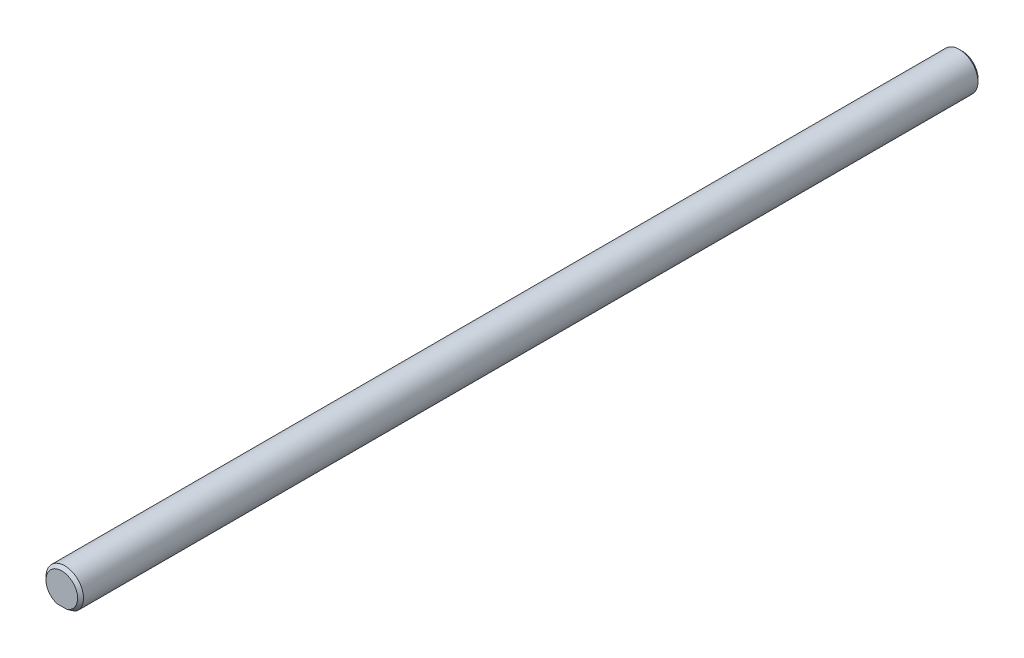
ISO-10303-21;
HEADER;
FILE_DESCRIPTION(('STEP AP214'),'2;1');
FILE_NAME('part.step','',(''),(''),'','','');
FILE_SCHEMA(('AUTOMOTIVE_DESIGN { 1 0 10303 214 1 1 1 1 }'));
ENDSEC;
DATA;
#1=APPLICATION_CONTEXT('core data for automotive mechanical design processes');
#2=APPLICATION_PROTOCOL_DEFINITION('international standard','automotive_design',2000,#1);
#3=PRODUCT_CONTEXT('',#1,'mechanical');
#4=PRODUCT('Part','Part','',(#3));
#5=PRODUCT_RELATED_PRODUCT_CATEGORY('part','',(#4));
#6=PRODUCT_DEFINITION_FORMATION('','',#4);
#7=PRODUCT_DEFINITION_CONTEXT('part definition',#1,'design');
#8=PRODUCT_DEFINITION('design','',#6,#7);
#9=PRODUCT_DEFINITION_SHAPE('','',#8);
#10=(LENGTH_UNIT() NAMED_UNIT(*) SI_UNIT(.MILLI.,.METRE.));
#11=(NAMED_UNIT(*) PLANE_ANGLE_UNIT() SI_UNIT($,.RADIAN.));
#12=(NAMED_UNIT(*) SI_UNIT($,.STERADIAN.) SOLID_ANGLE_UNIT());
#13=UNCERTAINTY_MEASURE_WITH_UNIT(LENGTH_MEASURE(1.E-05),#10,'distance_accuracy_value','');
#14=(GEOMETRIC_REPRESENTATION_CONTEXT(3) GLOBAL_UNCERTAINTY_ASSIGNED_CONTEXT((#13)) GLOBAL_UNIT_ASSIGNED_CONTEXT((#10,
#11,#12)) REPRESENTATION_CONTEXT('',''));
#15=CARTESIAN_POINT('',(0.,0.,0.));
#16=DIRECTION('',(0.,0.,1.));
#17=DIRECTION('',(1.,0.,0.));
#18=AXIS2_PLACEMENT_3D('',#15,#16,#17);
#19=CARTESIAN_POINT('',(0.,0.,-76.2));
#20=DIRECTION('',(0.,0.,-1.));
#21=DIRECTION('',(-1.,0.,0.));
#22=AXIS2_PLACEMENT_3D('',#19,#20,#21);
#23=PLANE('',#22);
#24=DIRECTION('',(1.,0.,0.));
#25=VECTOR('',#24,1.);
#26=CARTESIAN_POINT('',(-1.90500000000001,-2.54,-76.2));
#27=LINE('',#26,#25);
#28=CARTESIAN_POINT('',(-0.839061976256824,-2.54,-76.2));
#29=VERTEX_POINT('',#28);
#30=CARTESIAN_POINT('',(0.839061976256796,-2.54,-76.2));
#31=VERTEX_POINT('',#30);
#32=EDGE_CURVE('E102',#29,#31,#27,.T.);
#33=ORIENTED_EDGE('',*,*,#32,.F.);
#34=CARTESIAN_POINT('',(0.,0.,-76.2));
#35=DIRECTION('',(0.,0.,-1.));
#36=DIRECTION('',(-1.,0.,0.));
#37=AXIS2_PLACEMENT_3D('',#34,#35,#36);
#38=CIRCLE('',#37,2.675);
#39=EDGE_CURVE('E47',#29,#31,#38,.T.);
#40=ORIENTED_EDGE('',*,*,#39,.T.);
#41=EDGE_LOOP('',(#33,#40));
#42=FACE_BOUND('',#41,.T.);
#43=ADVANCED_FACE('F37',(#42),#23,.T.);
#44=CARTESIAN_POINT('',(0.,0.,76.2));
#45=DIRECTION('',(0.,0.,-1.));
#46=DIRECTION('',(-1.,0.,0.));
#47=AXIS2_PLACEMENT_3D('',#44,#45,#46);
#48=PLANE('',#47);
#49=DIRECTION('',(1.,0.,0.));
#50=VECTOR('',#49,1.);
#51=CARTESIAN_POINT('',(-1.90499999999999,-2.54,76.2));
#52=LINE('',#51,#50);
#53=CARTESIAN_POINT('',(-0.839061976256796,-2.54,76.2));
#54=VERTEX_POINT('',#53);
#55=CARTESIAN_POINT('',(0.839061976256825,-2.54,76.2));
#56=VERTEX_POINT('',#55);
#57=EDGE_CURVE('E98',#54,#56,#52,.T.);
#58=ORIENTED_EDGE('',*,*,#57,.T.);
#59=CARTESIAN_POINT('',(0.,0.,76.2));
#60=DIRECTION('',(0.,0.,-1.));
#61=DIRECTION('',(-1.,0.,0.));
#62=AXIS2_PLACEMENT_3D('',#59,#60,#61);
#63=CIRCLE('',#62,2.675);
#64=EDGE_CURVE('E11',#56,#54,#63,.F.);
#65=ORIENTED_EDGE('',*,*,#64,.T.);
#66=EDGE_LOOP('',(#58,#65));
#67=FACE_BOUND('',#66,.T.);
#68=ADVANCED_FACE('F122',(#67),#48,.F.);
#69=CARTESIAN_POINT('',(0.,0.,-76.2));
#70=DIRECTION('',(0.,0.,1.));
#71=DIRECTION('',(1.,0.,0.));
#72=AXIS2_PLACEMENT_3D('',#69,#70,#71);
#73=CYLINDRICAL_SURFACE('',#72,3.175);
#74=DIRECTION('',(0.,0.,1.));
#75=VECTOR('',#74,1.);
#76=CARTESIAN_POINT('',(1.90499999999999,-2.54,-76.2));
#77=LINE('',#76,#75);
#78=CARTESIAN_POINT('',(1.90499999999999,-2.54,-75.7));
#79=VERTEX_POINT('',#78);
#80=CARTESIAN_POINT('',(1.90500000000001,-2.54,75.6999999999999));
#81=VERTEX_POINT('',#80);
#82=EDGE_CURVE('E91',#79,#81,#77,.T.);
#83=ORIENTED_EDGE('',*,*,#82,.F.);
#84=CARTESIAN_POINT('',(0.,0.,-75.7));
#85=DIRECTION('',(0.,0.,-1.));
#86=DIRECTION('',(-1.,0.,0.));
#87=AXIS2_PLACEMENT_3D('',#84,#85,#86);
#88=CIRCLE('',#87,3.175);
#89=CARTESIAN_POINT('',(-1.90500000000001,-2.54,-75.7));
#90=VERTEX_POINT('',#89);
#91=EDGE_CURVE('E81',#79,#90,#88,.F.);
#92=ORIENTED_EDGE('',*,*,#91,.T.);
#93=DIRECTION('',(0.,0.,1.));
#94=VECTOR('',#93,1.);
#95=CARTESIAN_POINT('',(-1.90500000000001,-2.54,-76.2));
#96=LINE('',#95,#94);
#97=CARTESIAN_POINT('',(-1.90499999999999,-2.54,75.6999999999999));
#98=VERTEX_POINT('',#97);
#99=EDGE_CURVE('E88',#90,#98,#96,.T.);
#100=ORIENTED_EDGE('',*,*,#99,.T.);
#101=CARTESIAN_POINT('',(0.,0.,75.7));
#102=DIRECTION('',(0.,0.,-1.));
#103=DIRECTION('',(-1.,0.,0.));
#104=AXIS2_PLACEMENT_3D('',#101,#102,#103);
#105=CIRCLE('',#104,3.175);
#106=EDGE_CURVE('E93',#98,#81,#105,.T.);
#107=ORIENTED_EDGE('',*,*,#106,.T.);
#108=EDGE_LOOP('',(#83,#92,#100,#107));
#109=FACE_BOUND('',#108,.T.);
#110=ADVANCED_FACE('F87',(#109),#73,.T.);
#111=CARTESIAN_POINT('',(-1.90500000000001,-2.54,-76.2));
#112=DIRECTION('',(0.,-1.,0.));
#113=DIRECTION('',(0.,0.,-1.));
#114=AXIS2_PLACEMENT_3D('',#111,#112,#113);
#115=PLANE('',#114);
#116=ORIENTED_EDGE('',*,*,#99,.F.);
#117=CARTESIAN_POINT('',(-1.90500000000001,-2.54,-75.7));
#118=CARTESIAN_POINT('',(-1.82057616384333,-2.54,-75.7506120790583));
#119=CARTESIAN_POINT('',(-1.73520085655568,-2.54,-75.7997228081613));
#120=CARTESIAN_POINT('',(-1.56255506901466,-2.54,-75.8937439802083));
#121=CARTESIAN_POINT('',(-1.47529205702913,-2.54,-75.9386681953032));
#122=CARTESIAN_POINT('',(-1.2982218414941,-2.54,-76.0235188017369));
#123=CARTESIAN_POINT('',(-1.20841230086511,-2.54,-76.0634404070517));
#124=CARTESIAN_POINT('',(-1.0258856543589,-2.54,-76.1369210885128));
#125=CARTESIAN_POINT('',(-0.933159615756538,-2.54,-76.1704578240663));
#126=CARTESIAN_POINT('',(-0.83906197625682,-2.54,-76.2));
#127=B_SPLINE_CURVE_WITH_KNOTS('',3,(#117,#118,#119,#120,#121,#122,#123,#124,#125,#126),
.UNSPECIFIED.,.F.,.F.,(4,2,2,2,4),(0.,0.295344631156661,0.589680590550501,0.884296027084807,
1.17992410070187),.UNSPECIFIED.);
#128=EDGE_CURVE('E59',#90,#29,#127,.T.);
#129=ORIENTED_EDGE('',*,*,#128,.T.);
#130=ORIENTED_EDGE('',*,*,#32,.T.);
#131=CARTESIAN_POINT('',(0.839061976256796,-2.54,-76.2));
#132=CARTESIAN_POINT('',(0.933159615756512,-2.54,-76.1704578240663));
#133=CARTESIAN_POINT('',(1.02588565435887,-2.54,-76.1369210885128));
#134=CARTESIAN_POINT('',(1.20841230086509,-2.54,-76.0634404070517));
#135=CARTESIAN_POINT('',(1.29822184149408,-2.54,-76.0235188017369));
#136=CARTESIAN_POINT('',(1.47529205702911,-2.54,-75.9386681953032));
#137=CARTESIAN_POINT('',(1.56255506901464,-2.54,-75.8937439802083));
#138=CARTESIAN_POINT('',(1.73520085655565,-2.54,-75.7997228081613));
#139=CARTESIAN_POINT('',(1.8205761638433,-2.54,-75.7506120790583));
#140=CARTESIAN_POINT('',(1.90499999999999,-2.54,-75.7));
#141=B_SPLINE_CURVE_WITH_KNOTS('',3,(#131,#132,#133,#134,#135,#136,#137,#138,#139,#140),
.UNSPECIFIED.,.F.,.F.,(4,2,2,2,4),(0.,0.29562807361706,0.59024351015137,0.884579469545209,
1.17992410070187),.UNSPECIFIED.);
#142=EDGE_CURVE('E82',#31,#79,#141,.T.);
#143=ORIENTED_EDGE('',*,*,#142,.T.);
#144=ORIENTED_EDGE('',*,*,#82,.T.);
#145=CARTESIAN_POINT('',(1.90500000000001,-2.54,75.7));
#146=CARTESIAN_POINT('',(1.82057616384333,-2.54,75.7506120790583));
#147=CARTESIAN_POINT('',(1.73520085655568,-2.54,75.7997228081613));
#148=CARTESIAN_POINT('',(1.56255506901466,-2.54,75.8937439802083));
#149=CARTESIAN_POINT('',(1.47529205702913,-2.54,75.9386681953032));
#150=CARTESIAN_POINT('',(1.2982218414941,-2.54,76.0235188017369));
#151=CARTESIAN_POINT('',(1.20841230086511,-2.54,76.0634404070517));
#152=CARTESIAN_POINT('',(1.0258856543589,-2.54,76.1369210885128));
#153=CARTESIAN_POINT('',(0.933159615756538,-2.54,76.1704578240663));
#154=CARTESIAN_POINT('',(0.83906197625682,-2.54,76.2));
#155=B_SPLINE_CURVE_WITH_KNOTS('',3,(#145,#146,#147,#148,#149,#150,#151,#152,#153,#154),
.UNSPECIFIED.,.F.,.F.,(4,2,2,2,4),(0.,0.295344631156661,0.589680590550501,0.884296027084807,
1.17992410070187),.UNSPECIFIED.);
#156=EDGE_CURVE('E92',#81,#56,#155,.T.);
#157=ORIENTED_EDGE('',*,*,#156,.T.);
#158=ORIENTED_EDGE('',*,*,#57,.F.);
#159=CARTESIAN_POINT('',(-0.839061976256796,-2.54,76.2));
#160=CARTESIAN_POINT('',(-0.933159615756514,-2.54,76.1704578240663));
#161=CARTESIAN_POINT('',(-1.02588565435887,-2.54,76.1369210885128));
#162=CARTESIAN_POINT('',(-1.20841230086509,-2.54,76.0634404070517));
#163=CARTESIAN_POINT('',(-1.29822184149408,-2.54,76.0235188017369));
#164=CARTESIAN_POINT('',(-1.47529205702911,-2.54,75.9386681953032));
#165=CARTESIAN_POINT('',(-1.56255506901464,-2.54,75.8937439802083));
#166=CARTESIAN_POINT('',(-1.73520085655565,-2.54,75.7997228081613));
#167=CARTESIAN_POINT('',(-1.8205761638433,-2.54,75.7506120790583));
#168=CARTESIAN_POINT('',(-1.90499999999999,-2.54,75.7));
#169=B_SPLINE_CURVE_WITH_KNOTS('',3,(#159,#160,#161,#162,#163,#164,#165,#166,#167,#168),
.UNSPECIFIED.,.F.,.F.,(4,2,2,2,4),(0.,0.295628073617064,0.59024351015137,0.884579469545209,
1.17992410070187),.UNSPECIFIED.);
#170=EDGE_CURVE('E97',#54,#98,#169,.T.);
#171=ORIENTED_EDGE('',*,*,#170,.T.);
#172=EDGE_LOOP('',(#116,#129,#130,#143,#144,#157,#158,#171));
#173=FACE_BOUND('',#172,.T.);
#174=ADVANCED_FACE('F95',(#173),#115,.T.);
#175=CARTESIAN_POINT('',(0.,0.,-75.7));
#176=DIRECTION('',(0.,0.,1.));
#177=DIRECTION('',(1.,0.,0.));
#178=AXIS2_PLACEMENT_3D('',#175,#176,#177);
#179=CONICAL_SURFACE('',#178,3.175,0.785398163397451);
#180=ORIENTED_EDGE('',*,*,#142,.F.);
#181=ORIENTED_EDGE('',*,*,#39,.F.);
#182=ORIENTED_EDGE('',*,*,#128,.F.);
#183=ORIENTED_EDGE('',*,*,#91,.F.);
#184=EDGE_LOOP('',(#180,#181,#182,#183));
#185=FACE_BOUND('',#184,.T.);
#186=ADVANCED_FACE('F80',(#185),#179,.T.);
#187=CARTESIAN_POINT('',(0.,0.,76.2));
#188=DIRECTION('',(0.,0.,-1.));
#189=DIRECTION('',(-1.,0.,0.));
#190=AXIS2_PLACEMENT_3D('',#187,#188,#189);
#191=CONICAL_SURFACE('',#190,2.675,0.785398163397451);
#192=ORIENTED_EDGE('',*,*,#156,.F.);
#193=ORIENTED_EDGE('',*,*,#106,.F.);
#194=ORIENTED_EDGE('',*,*,#170,.F.);
#195=ORIENTED_EDGE('',*,*,#64,.F.);
#196=EDGE_LOOP('',(#192,#193,#194,#195));
#197=FACE_BOUND('',#196,.T.);
#198=ADVANCED_FACE('F40',(#197),#191,.T.);
#199=CLOSED_SHELL('',(#43,#68,#110,#174,#186,#198));
#200=MANIFOLD_SOLID_BREP('B2',#199);
#201=ADVANCED_BREP_SHAPE_REPRESENTATION('',(#18,#200),#14);
#202=SHAPE_DEFINITION_REPRESENTATION(#9,#201);
ENDSEC;
END-ISO-10303-21;
